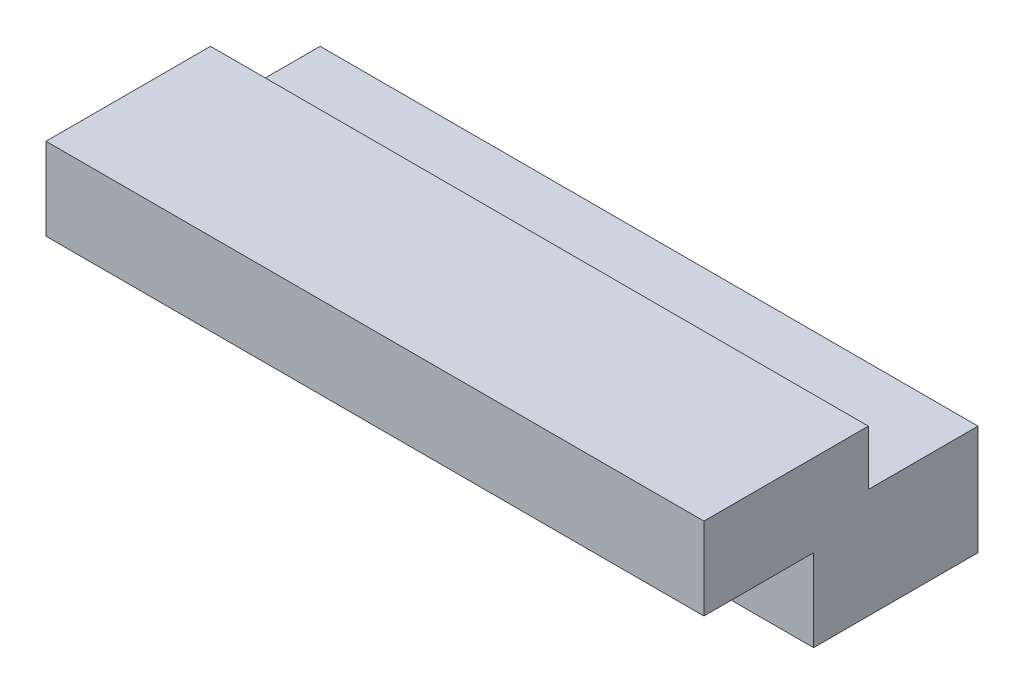
ISO-10303-21;
HEADER;
FILE_DESCRIPTION(('STEP AP214'),'2;1');
FILE_NAME('part.step','',(''),(''),'','','');
FILE_SCHEMA(('AUTOMOTIVE_DESIGN { 1 0 10303 214 1 1 1 1 }'));
ENDSEC;
DATA;
#1=APPLICATION_CONTEXT('core data for automotive mechanical design processes');
#2=APPLICATION_PROTOCOL_DEFINITION('international standard','automotive_design',2000,#1);
#3=PRODUCT_CONTEXT('',#1,'mechanical');
#4=PRODUCT('Part','Part','',(#3));
#5=PRODUCT_RELATED_PRODUCT_CATEGORY('part','',(#4));
#6=PRODUCT_DEFINITION_FORMATION('','',#4);
#7=PRODUCT_DEFINITION_CONTEXT('part definition',#1,'design');
#8=PRODUCT_DEFINITION('design','',#6,#7);
#9=PRODUCT_DEFINITION_SHAPE('','',#8);
#10=(LENGTH_UNIT() NAMED_UNIT(*) SI_UNIT(.MILLI.,.METRE.));
#11=(NAMED_UNIT(*) PLANE_ANGLE_UNIT() SI_UNIT($,.RADIAN.));
#12=(NAMED_UNIT(*) SI_UNIT($,.STERADIAN.) SOLID_ANGLE_UNIT());
#13=UNCERTAINTY_MEASURE_WITH_UNIT(LENGTH_MEASURE(1.E-05),#10,'distance_accuracy_value','');
#14=(GEOMETRIC_REPRESENTATION_CONTEXT(3) GLOBAL_UNCERTAINTY_ASSIGNED_CONTEXT((#13)) GLOBAL_UNIT_ASSIGNED_CONTEXT((#10,
#11,#12)) REPRESENTATION_CONTEXT('',''));
#15=CARTESIAN_POINT('',(0.,0.,0.));
#16=DIRECTION('',(0.,0.,1.));
#17=DIRECTION('',(1.,0.,0.));
#18=AXIS2_PLACEMENT_3D('',#15,#16,#17);
#19=CARTESIAN_POINT('',(0.,0.,19.3239731540357));
#20=DIRECTION('',(0.,0.,-1.));
#21=DIRECTION('',(-1.,0.,0.));
#22=AXIS2_PLACEMENT_3D('',#19,#20,#21);
#23=PLANE('',#22);
#24=DIRECTION('',(1.,0.,0.));
#25=VECTOR('',#24,1.);
#26=CARTESIAN_POINT('',(-3.36848900257427,-2.4121633647549,19.3239731540357));
#27=LINE('',#26,#25);
#28=CARTESIAN_POINT('',(-3.36848900257427,-2.4121633647549,19.3239731540357));
#29=VERTEX_POINT('',#28);
#30=CARTESIAN_POINT('',(56.6315109974257,-2.4121633647549,19.3239731540357));
#31=VERTEX_POINT('',#30);
#32=EDGE_CURVE('E48',#29,#31,#27,.T.);
#33=ORIENTED_EDGE('',*,*,#32,.F.);
#34=DIRECTION('',(0.,-1.,0.));
#35=VECTOR('',#34,1.);
#36=CARTESIAN_POINT('',(-3.36848900257427,-9.9121633647549,19.3239731540357));
#37=LINE('',#36,#35);
#38=CARTESIAN_POINT('',(-3.36848900257427,-9.9121633647549,19.3239731540357));
#39=VERTEX_POINT('',#38);
#40=EDGE_CURVE('E122',#29,#39,#37,.T.);
#41=ORIENTED_EDGE('',*,*,#40,.T.);
#42=DIRECTION('',(1.,0.,0.));
#43=VECTOR('',#42,1.);
#44=CARTESIAN_POINT('',(-3.36848900257427,-9.9121633647549,19.3239731540357));
#45=LINE('',#44,#43);
#46=CARTESIAN_POINT('',(56.6315109974257,-9.9121633647549,19.3239731540357));
#47=VERTEX_POINT('',#46);
#48=EDGE_CURVE('E141',#39,#47,#45,.T.);
#49=ORIENTED_EDGE('',*,*,#48,.T.);
#50=DIRECTION('',(0.,1.,0.));
#51=VECTOR('',#50,1.);
#52=CARTESIAN_POINT('',(56.6315109974257,-9.9121633647549,19.3239731540357));
#53=LINE('',#52,#51);
#54=EDGE_CURVE('E144',#47,#31,#53,.T.);
#55=ORIENTED_EDGE('',*,*,#54,.T.);
#56=EDGE_LOOP('',(#33,#41,#49,#55));
#57=FACE_BOUND('',#56,.T.);
#58=ADVANCED_FACE('F33',(#57),#23,.F.);
#59=CARTESIAN_POINT('',(0.,0.0878366352451038,0.));
#60=DIRECTION('',(0.,-1.,0.));
#61=DIRECTION('',(0.,0.,-1.));
#62=AXIS2_PLACEMENT_3D('',#59,#60,#61);
#63=PLANE('',#62);
#64=DIRECTION('',(-1.,0.,0.));
#65=VECTOR('',#64,1.);
#66=CARTESIAN_POINT('',(-3.36848900257427,0.0878366352451038,14.3239731540357));
#67=LINE('',#66,#65);
#68=CARTESIAN_POINT('',(56.6315109974257,0.0878366352451038,14.3239731540357));
#69=VERTEX_POINT('',#68);
#70=CARTESIAN_POINT('',(-3.36848900257427,0.0878366352451038,14.3239731540357));
#71=VERTEX_POINT('',#70);
#72=EDGE_CURVE('E56',#69,#71,#67,.T.);
#73=ORIENTED_EDGE('',*,*,#72,.F.);
#74=DIRECTION('',(0.,0.,1.));
#75=VECTOR('',#74,1.);
#76=CARTESIAN_POINT('',(56.6315109974257,0.0878366352451038,4.32397315403572));
#77=LINE('',#76,#75);
#78=CARTESIAN_POINT('',(56.6315109974257,0.0878366352451038,4.32397315403572));
#79=VERTEX_POINT('',#78);
#80=EDGE_CURVE('E146',#79,#69,#77,.T.);
#81=ORIENTED_EDGE('',*,*,#80,.F.);
#82=DIRECTION('',(1.,0.,0.));
#83=VECTOR('',#82,1.);
#84=CARTESIAN_POINT('',(56.6315109974257,0.0878366352451038,4.32397315403572));
#85=LINE('',#84,#83);
#86=CARTESIAN_POINT('',(-3.36848900257427,0.0878366352451038,4.32397315403571));
#87=VERTEX_POINT('',#86);
#88=EDGE_CURVE('E150',#87,#79,#85,.T.);
#89=ORIENTED_EDGE('',*,*,#88,.F.);
#90=DIRECTION('',(0.,0.,-1.));
#91=VECTOR('',#90,1.);
#92=CARTESIAN_POINT('',(-3.36848900257427,0.0878366352451038,4.32397315403571));
#93=LINE('',#92,#91);
#94=EDGE_CURVE('E155',#71,#87,#93,.T.);
#95=ORIENTED_EDGE('',*,*,#94,.F.);
#96=EDGE_LOOP('',(#73,#81,#89,#95));
#97=FACE_BOUND('',#96,.T.);
#98=ADVANCED_FACE('F166',(#97),#63,.F.);
#99=CARTESIAN_POINT('',(56.6315109974257,-9.9121633647549,4.32397315403572));
#100=DIRECTION('',(-1.,0.,0.));
#101=DIRECTION('',(0.,0.,1.));
#102=AXIS2_PLACEMENT_3D('',#99,#100,#101);
#103=PLANE('',#102);
#104=ORIENTED_EDGE('',*,*,#80,.T.);
#105=DIRECTION('',(0.,-1.,0.));
#106=VECTOR('',#105,1.);
#107=CARTESIAN_POINT('',(56.6315109974257,5.0878366352451,14.3239731540357));
#108=LINE('',#107,#106);
#109=CARTESIAN_POINT('',(56.6315109974257,5.0878366352451,14.3239731540357));
#110=VERTEX_POINT('',#109);
#111=EDGE_CURVE('E137',#110,#69,#108,.T.);
#112=ORIENTED_EDGE('',*,*,#111,.F.);
#113=DIRECTION('',(0.,0.,-1.));
#114=VECTOR('',#113,1.);
#115=CARTESIAN_POINT('',(56.6315109974257,5.0878366352451,19.3239731540357));
#116=LINE('',#115,#114);
#117=CARTESIAN_POINT('',(56.6315109974257,5.0878366352451,29.3239731540357));
#118=VERTEX_POINT('',#117);
#119=EDGE_CURVE('E130',#118,#110,#116,.T.);
#120=ORIENTED_EDGE('',*,*,#119,.F.);
#121=DIRECTION('',(0.,1.,0.));
#122=VECTOR('',#121,1.);
#123=CARTESIAN_POINT('',(56.6315109974257,5.0878366352451,29.3239731540357));
#124=LINE('',#123,#122);
#125=CARTESIAN_POINT('',(56.6315109974257,-2.4121633647549,29.3239731540357));
#126=VERTEX_POINT('',#125);
#127=EDGE_CURVE('E109',#126,#118,#124,.T.);
#128=ORIENTED_EDGE('',*,*,#127,.F.);
#129=DIRECTION('',(0.,0.,-1.));
#130=VECTOR('',#129,1.);
#131=CARTESIAN_POINT('',(56.6315109974257,-2.4121633647549,29.3239731540357));
#132=LINE('',#131,#130);
#133=EDGE_CURVE('E105',#126,#31,#132,.T.);
#134=ORIENTED_EDGE('',*,*,#133,.T.);
#135=ORIENTED_EDGE('',*,*,#54,.F.);
#136=DIRECTION('',(0.,0.,1.));
#137=VECTOR('',#136,1.);
#138=CARTESIAN_POINT('',(56.6315109974257,-9.9121633647549,4.32397315403572));
#139=LINE('',#138,#137);
#140=CARTESIAN_POINT('',(56.6315109974257,-9.9121633647549,4.32397315403572));
#141=VERTEX_POINT('',#140);
#142=EDGE_CURVE('E147',#141,#47,#139,.T.);
#143=ORIENTED_EDGE('',*,*,#142,.F.);
#144=DIRECTION('',(0.,1.,0.));
#145=VECTOR('',#144,1.);
#146=CARTESIAN_POINT('',(56.6315109974257,-9.9121633647549,4.32397315403572));
#147=LINE('',#146,#145);
#148=EDGE_CURVE('E41',#141,#79,#147,.T.);
#149=ORIENTED_EDGE('',*,*,#148,.T.);
#150=EDGE_LOOP('',(#104,#112,#120,#128,#134,#135,#143,#149));
#151=FACE_BOUND('',#150,.T.);
#152=ADVANCED_FACE('F35',(#151),#103,.F.);
#153=CARTESIAN_POINT('',(-3.36848900257427,-9.9121633647549,4.32397315403571));
#154=DIRECTION('',(1.,0.,0.));
#155=DIRECTION('',(0.,0.,-1.));
#156=AXIS2_PLACEMENT_3D('',#153,#154,#155);
#157=PLANE('',#156);
#158=ORIENTED_EDGE('',*,*,#40,.F.);
#159=DIRECTION('',(0.,0.,-1.));
#160=VECTOR('',#159,1.);
#161=CARTESIAN_POINT('',(-3.36848900257427,-2.4121633647549,29.3239731540357));
#162=LINE('',#161,#160);
#163=CARTESIAN_POINT('',(-3.36848900257427,-2.4121633647549,29.3239731540357));
#164=VERTEX_POINT('',#163);
#165=EDGE_CURVE('E103',#164,#29,#162,.T.);
#166=ORIENTED_EDGE('',*,*,#165,.F.);
#167=DIRECTION('',(0.,-1.,0.));
#168=VECTOR('',#167,1.);
#169=CARTESIAN_POINT('',(-3.36848900257427,5.0878366352451,29.3239731540357));
#170=LINE('',#169,#168);
#171=CARTESIAN_POINT('',(-3.36848900257427,5.0878366352451,29.3239731540357));
#172=VERTEX_POINT('',#171);
#173=EDGE_CURVE('E110',#172,#164,#170,.T.);
#174=ORIENTED_EDGE('',*,*,#173,.F.);
#175=DIRECTION('',(0.,0.,1.));
#176=VECTOR('',#175,1.);
#177=CARTESIAN_POINT('',(-3.36848900257427,5.0878366352451,19.3239731540357));
#178=LINE('',#177,#176);
#179=CARTESIAN_POINT('',(-3.36848900257427,5.0878366352451,14.3239731540357));
#180=VERTEX_POINT('',#179);
#181=EDGE_CURVE('E124',#180,#172,#178,.T.);
#182=ORIENTED_EDGE('',*,*,#181,.F.);
#183=DIRECTION('',(0.,-1.,0.));
#184=VECTOR('',#183,1.);
#185=CARTESIAN_POINT('',(-3.36848900257427,5.0878366352451,14.3239731540357));
#186=LINE('',#185,#184);
#187=EDGE_CURVE('E133',#180,#71,#186,.T.);
#188=ORIENTED_EDGE('',*,*,#187,.T.);
#189=ORIENTED_EDGE('',*,*,#94,.T.);
#190=DIRECTION('',(0.,1.,0.));
#191=VECTOR('',#190,1.);
#192=CARTESIAN_POINT('',(-3.36848900257427,-9.9121633647549,4.32397315403571));
#193=LINE('',#192,#191);
#194=CARTESIAN_POINT('',(-3.36848900257427,-9.9121633647549,4.32397315403571));
#195=VERTEX_POINT('',#194);
#196=EDGE_CURVE('E11',#195,#87,#193,.T.);
#197=ORIENTED_EDGE('',*,*,#196,.F.);
#198=DIRECTION('',(0.,0.,-1.));
#199=VECTOR('',#198,1.);
#200=CARTESIAN_POINT('',(-3.36848900257427,-9.9121633647549,4.32397315403571));
#201=LINE('',#200,#199);
#202=EDGE_CURVE('E149',#39,#195,#201,.T.);
#203=ORIENTED_EDGE('',*,*,#202,.F.);
#204=EDGE_LOOP('',(#158,#166,#174,#182,#188,#189,#197,#203));
#205=FACE_BOUND('',#204,.T.);
#206=ADVANCED_FACE('F120',(#205),#157,.F.);
#207=CARTESIAN_POINT('',(56.6315109974257,-9.9121633647549,4.32397315403572));
#208=DIRECTION('',(0.,0.,1.));
#209=DIRECTION('',(1.,0.,0.));
#210=AXIS2_PLACEMENT_3D('',#207,#208,#209);
#211=PLANE('',#210);
#212=ORIENTED_EDGE('',*,*,#88,.T.);
#213=ORIENTED_EDGE('',*,*,#148,.F.);
#214=DIRECTION('',(1.,0.,0.));
#215=VECTOR('',#214,1.);
#216=CARTESIAN_POINT('',(56.6315109974257,-9.9121633647549,4.32397315403572));
#217=LINE('',#216,#215);
#218=EDGE_CURVE('E152',#195,#141,#217,.T.);
#219=ORIENTED_EDGE('',*,*,#218,.F.);
#220=ORIENTED_EDGE('',*,*,#196,.T.);
#221=EDGE_LOOP('',(#212,#213,#219,#220));
#222=FACE_BOUND('',#221,.T.);
#223=ADVANCED_FACE('F167',(#222),#211,.F.);
#224=CARTESIAN_POINT('',(0.,-9.9121633647549,0.));
#225=DIRECTION('',(0.,-1.,0.));
#226=DIRECTION('',(0.,0.,-1.));
#227=AXIS2_PLACEMENT_3D('',#224,#225,#226);
#228=PLANE('',#227);
#229=ORIENTED_EDGE('',*,*,#142,.T.);
#230=ORIENTED_EDGE('',*,*,#48,.F.);
#231=ORIENTED_EDGE('',*,*,#202,.T.);
#232=ORIENTED_EDGE('',*,*,#218,.T.);
#233=EDGE_LOOP('',(#229,#230,#231,#232));
#234=FACE_BOUND('',#233,.T.);
#235=ADVANCED_FACE('F179',(#234),#228,.T.);
#236=CARTESIAN_POINT('',(-3.36848900257427,5.0878366352451,14.3239731540357));
#237=DIRECTION('',(0.,0.,1.));
#238=DIRECTION('',(1.,0.,0.));
#239=AXIS2_PLACEMENT_3D('',#236,#237,#238);
#240=PLANE('',#239);
#241=ORIENTED_EDGE('',*,*,#72,.T.);
#242=ORIENTED_EDGE('',*,*,#187,.F.);
#243=DIRECTION('',(-1.,0.,0.));
#244=VECTOR('',#243,1.);
#245=CARTESIAN_POINT('',(-3.36848900257427,5.0878366352451,14.3239731540357));
#246=LINE('',#245,#244);
#247=EDGE_CURVE('E132',#110,#180,#246,.T.);
#248=ORIENTED_EDGE('',*,*,#247,.F.);
#249=ORIENTED_EDGE('',*,*,#111,.T.);
#250=EDGE_LOOP('',(#241,#242,#248,#249));
#251=FACE_BOUND('',#250,.T.);
#252=ADVANCED_FACE('F173',(#251),#240,.F.);
#253=CARTESIAN_POINT('',(0.,5.0878366352451,0.));
#254=DIRECTION('',(0.,-1.,0.));
#255=DIRECTION('',(0.,0.,-1.));
#256=AXIS2_PLACEMENT_3D('',#253,#254,#255);
#257=PLANE('',#256);
#258=ORIENTED_EDGE('',*,*,#181,.T.);
#259=DIRECTION('',(-1.,0.,0.));
#260=VECTOR('',#259,1.);
#261=CARTESIAN_POINT('',(-3.36848900257427,5.0878366352451,29.3239731540357));
#262=LINE('',#261,#260);
#263=EDGE_CURVE('E116',#118,#172,#262,.T.);
#264=ORIENTED_EDGE('',*,*,#263,.F.);
#265=ORIENTED_EDGE('',*,*,#119,.T.);
#266=ORIENTED_EDGE('',*,*,#247,.T.);
#267=EDGE_LOOP('',(#258,#264,#265,#266));
#268=FACE_BOUND('',#267,.T.);
#269=ADVANCED_FACE('F176',(#268),#257,.F.);
#270=CARTESIAN_POINT('',(-3.36848900257427,-2.4121633647549,29.3239731540357));
#271=DIRECTION('',(0.,1.,0.));
#272=DIRECTION('',(0.,0.,1.));
#273=AXIS2_PLACEMENT_3D('',#270,#271,#272);
#274=PLANE('',#273);
#275=ORIENTED_EDGE('',*,*,#32,.T.);
#276=ORIENTED_EDGE('',*,*,#133,.F.);
#277=DIRECTION('',(1.,0.,0.));
#278=VECTOR('',#277,1.);
#279=CARTESIAN_POINT('',(-3.36848900257427,-2.4121633647549,29.3239731540357));
#280=LINE('',#279,#278);
#281=EDGE_CURVE('E99',#164,#126,#280,.T.);
#282=ORIENTED_EDGE('',*,*,#281,.F.);
#283=ORIENTED_EDGE('',*,*,#165,.T.);
#284=EDGE_LOOP('',(#275,#276,#282,#283));
#285=FACE_BOUND('',#284,.T.);
#286=ADVANCED_FACE('F101',(#285),#274,.F.);
#287=CARTESIAN_POINT('',(0.,0.,29.3239731540357));
#288=DIRECTION('',(0.,0.,1.));
#289=DIRECTION('',(1.,0.,0.));
#290=AXIS2_PLACEMENT_3D('',#287,#288,#289);
#291=PLANE('',#290);
#292=ORIENTED_EDGE('',*,*,#173,.T.);
#293=ORIENTED_EDGE('',*,*,#281,.T.);
#294=ORIENTED_EDGE('',*,*,#127,.T.);
#295=ORIENTED_EDGE('',*,*,#263,.T.);
#296=EDGE_LOOP('',(#292,#293,#294,#295));
#297=FACE_BOUND('',#296,.T.);
#298=ADVANCED_FACE('F114',(#297),#291,.T.);
#299=CLOSED_SHELL('',(#58,#98,#152,#206,#223,#235,#252,#269,#286,#298));
#300=MANIFOLD_SOLID_BREP('B2',#299);
#301=ADVANCED_BREP_SHAPE_REPRESENTATION('',(#18,#300),#14);
#302=SHAPE_DEFINITION_REPRESENTATION(#9,#301);
ENDSEC;
END-ISO-10303-21;
